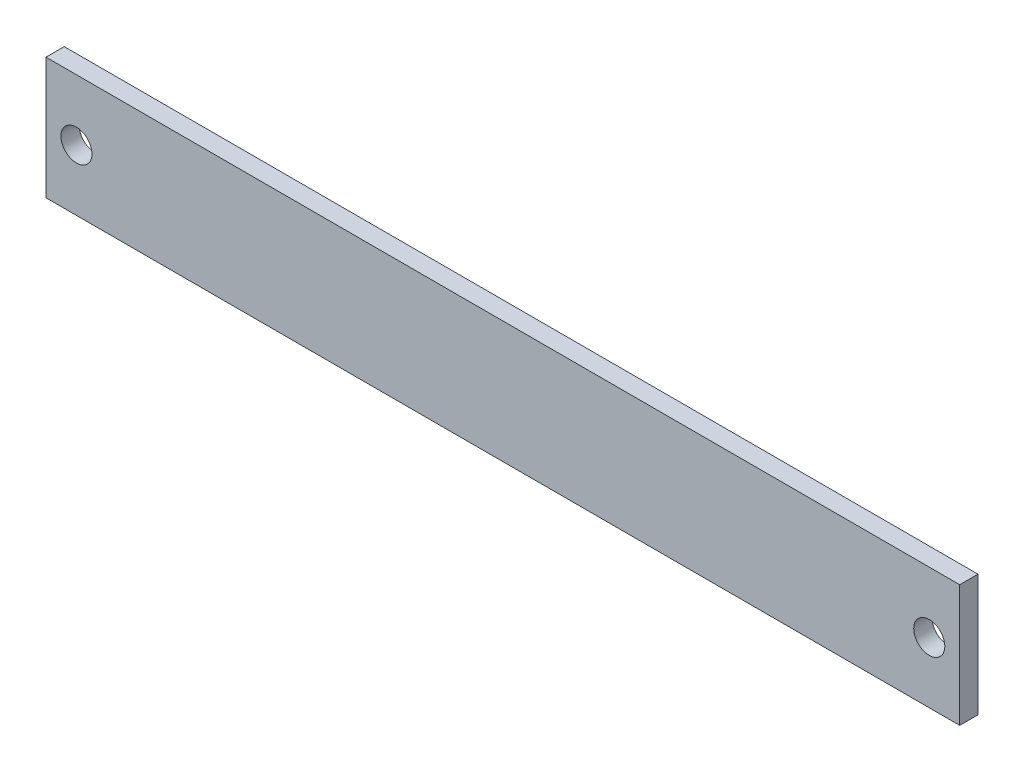
ISO-10303-21;
HEADER;
FILE_DESCRIPTION(('STEP AP214'),'2;1');
FILE_NAME('part.step','',(''),(''),'','','');
FILE_SCHEMA(('AUTOMOTIVE_DESIGN { 1 0 10303 214 1 1 1 1 }'));
ENDSEC;
DATA;
#1=APPLICATION_CONTEXT('core data for automotive mechanical design processes');
#2=APPLICATION_PROTOCOL_DEFINITION('international standard','automotive_design',2000,#1);
#3=PRODUCT_CONTEXT('',#1,'mechanical');
#4=PRODUCT('Part','Part','',(#3));
#5=PRODUCT_RELATED_PRODUCT_CATEGORY('part','',(#4));
#6=PRODUCT_DEFINITION_FORMATION('','',#4);
#7=PRODUCT_DEFINITION_CONTEXT('part definition',#1,'design');
#8=PRODUCT_DEFINITION('design','',#6,#7);
#9=PRODUCT_DEFINITION_SHAPE('','',#8);
#10=(LENGTH_UNIT() NAMED_UNIT(*) SI_UNIT(.MILLI.,.METRE.));
#11=(NAMED_UNIT(*) PLANE_ANGLE_UNIT() SI_UNIT($,.RADIAN.));
#12=(NAMED_UNIT(*) SI_UNIT($,.STERADIAN.) SOLID_ANGLE_UNIT());
#13=UNCERTAINTY_MEASURE_WITH_UNIT(LENGTH_MEASURE(1.E-05),#10,'distance_accuracy_value','');
#14=(GEOMETRIC_REPRESENTATION_CONTEXT(3) GLOBAL_UNCERTAINTY_ASSIGNED_CONTEXT((#13)) GLOBAL_UNIT_ASSIGNED_CONTEXT((#10,
#11,#12)) REPRESENTATION_CONTEXT('',''));
#15=CARTESIAN_POINT('',(0.,0.,0.));
#16=DIRECTION('',(0.,0.,1.));
#17=DIRECTION('',(1.,0.,0.));
#18=AXIS2_PLACEMENT_3D('',#15,#16,#17);
#19=CARTESIAN_POINT('',(0.,0.,6.));
#20=DIRECTION('',(0.,0.,1.));
#21=DIRECTION('',(1.,0.,0.));
#22=AXIS2_PLACEMENT_3D('',#19,#20,#21);
#23=PLANE('',#22);
#24=CARTESIAN_POINT('',(-140.,0.,6.));
#25=DIRECTION('',(0.,0.,1.));
#26=DIRECTION('',(1.,0.,0.));
#27=AXIS2_PLACEMENT_3D('',#24,#25,#26);
#28=CIRCLE('',#27,5.09999999999998);
#29=CARTESIAN_POINT('',(-134.9,0.,6.));
#30=VERTEX_POINT('',#29);
#31=EDGE_CURVE('E102',#30,#30,#28,.T.);
#32=ORIENTED_EDGE('',*,*,#31,.F.);
#33=EDGE_LOOP('',(#32));
#34=FACE_BOUND('',#33,.T.);
#35=DIRECTION('',(0.,1.,0.));
#36=VECTOR('',#35,1.);
#37=CARTESIAN_POINT('',(150.,20.,6.));
#38=LINE('',#37,#36);
#39=CARTESIAN_POINT('',(150.,-20.,6.));
#40=VERTEX_POINT('',#39);
#41=CARTESIAN_POINT('',(150.,20.,6.));
#42=VERTEX_POINT('',#41);
#43=EDGE_CURVE('E87',#40,#42,#38,.T.);
#44=ORIENTED_EDGE('',*,*,#43,.T.);
#45=DIRECTION('',(-1.,0.,0.));
#46=VECTOR('',#45,1.);
#47=CARTESIAN_POINT('',(-150.,20.,6.));
#48=LINE('',#47,#46);
#49=CARTESIAN_POINT('',(-150.,20.,6.));
#50=VERTEX_POINT('',#49);
#51=EDGE_CURVE('E82',#42,#50,#48,.T.);
#52=ORIENTED_EDGE('',*,*,#51,.T.);
#53=DIRECTION('',(0.,-1.,0.));
#54=VECTOR('',#53,1.);
#55=CARTESIAN_POINT('',(-150.,20.,6.));
#56=LINE('',#55,#54);
#57=CARTESIAN_POINT('',(-150.,-20.,6.));
#58=VERTEX_POINT('',#57);
#59=EDGE_CURVE('E85',#50,#58,#56,.T.);
#60=ORIENTED_EDGE('',*,*,#59,.T.);
#61=DIRECTION('',(1.,0.,0.));
#62=VECTOR('',#61,1.);
#63=CARTESIAN_POINT('',(-150.,-20.,6.));
#64=LINE('',#63,#62);
#65=EDGE_CURVE('E52',#58,#40,#64,.T.);
#66=ORIENTED_EDGE('',*,*,#65,.T.);
#67=EDGE_LOOP('',(#44,#52,#60,#66));
#68=FACE_BOUND('',#67,.T.);
#69=CARTESIAN_POINT('',(140.,0.,6.));
#70=DIRECTION('',(0.,0.,1.));
#71=DIRECTION('',(-1.,0.,0.));
#72=AXIS2_PLACEMENT_3D('',#69,#70,#71);
#73=CIRCLE('',#72,5.09999999999998);
#74=CARTESIAN_POINT('',(134.9,0.,6.));
#75=VERTEX_POINT('',#74);
#76=EDGE_CURVE('E117',#75,#75,#73,.T.);
#77=ORIENTED_EDGE('',*,*,#76,.F.);
#78=EDGE_LOOP('',(#77));
#79=FACE_BOUND('',#78,.T.);
#80=ADVANCED_FACE('F35',(#34,#68,#79),#23,.T.);
#81=CARTESIAN_POINT('',(0.,0.,0.));
#82=DIRECTION('',(0.,0.,1.));
#83=DIRECTION('',(1.,0.,0.));
#84=AXIS2_PLACEMENT_3D('',#81,#82,#83);
#85=PLANE('',#84);
#86=DIRECTION('',(0.,1.,0.));
#87=VECTOR('',#86,1.);
#88=CARTESIAN_POINT('',(150.,20.,0.));
#89=LINE('',#88,#87);
#90=CARTESIAN_POINT('',(150.,-20.,0.));
#91=VERTEX_POINT('',#90);
#92=CARTESIAN_POINT('',(150.,20.,0.));
#93=VERTEX_POINT('',#92);
#94=EDGE_CURVE('E99',#91,#93,#89,.T.);
#95=ORIENTED_EDGE('',*,*,#94,.F.);
#96=DIRECTION('',(1.,0.,0.));
#97=VECTOR('',#96,1.);
#98=CARTESIAN_POINT('',(-150.,-20.,0.));
#99=LINE('',#98,#97);
#100=CARTESIAN_POINT('',(-150.,-20.,0.));
#101=VERTEX_POINT('',#100);
#102=EDGE_CURVE('E75',#101,#91,#99,.T.);
#103=ORIENTED_EDGE('',*,*,#102,.F.);
#104=DIRECTION('',(0.,-1.,0.));
#105=VECTOR('',#104,1.);
#106=CARTESIAN_POINT('',(-150.,20.,0.));
#107=LINE('',#106,#105);
#108=CARTESIAN_POINT('',(-150.,20.,0.));
#109=VERTEX_POINT('',#108);
#110=EDGE_CURVE('E69',#109,#101,#107,.T.);
#111=ORIENTED_EDGE('',*,*,#110,.F.);
#112=DIRECTION('',(-1.,0.,0.));
#113=VECTOR('',#112,1.);
#114=CARTESIAN_POINT('',(-150.,20.,0.));
#115=LINE('',#114,#113);
#116=EDGE_CURVE('E91',#93,#109,#115,.T.);
#117=ORIENTED_EDGE('',*,*,#116,.F.);
#118=EDGE_LOOP('',(#95,#103,#111,#117));
#119=FACE_BOUND('',#118,.T.);
#120=CARTESIAN_POINT('',(-140.,0.,0.));
#121=DIRECTION('',(0.,0.,1.));
#122=DIRECTION('',(1.,0.,0.));
#123=AXIS2_PLACEMENT_3D('',#120,#121,#122);
#124=CIRCLE('',#123,5.09999999999998);
#125=CARTESIAN_POINT('',(-134.9,0.,0.));
#126=VERTEX_POINT('',#125);
#127=EDGE_CURVE('E114',#126,#126,#124,.T.);
#128=ORIENTED_EDGE('',*,*,#127,.T.);
#129=EDGE_LOOP('',(#128));
#130=FACE_BOUND('',#129,.T.);
#131=CARTESIAN_POINT('',(140.,0.,0.));
#132=DIRECTION('',(0.,0.,1.));
#133=DIRECTION('',(-1.,0.,0.));
#134=AXIS2_PLACEMENT_3D('',#131,#132,#133);
#135=CIRCLE('',#134,5.09999999999998);
#136=CARTESIAN_POINT('',(134.9,0.,0.));
#137=VERTEX_POINT('',#136);
#138=EDGE_CURVE('E120',#137,#137,#135,.T.);
#139=ORIENTED_EDGE('',*,*,#138,.T.);
#140=EDGE_LOOP('',(#139));
#141=FACE_BOUND('',#140,.T.);
#142=ADVANCED_FACE('F110',(#119,#130,#141),#85,.F.);
#143=CARTESIAN_POINT('',(150.,20.,6.));
#144=DIRECTION('',(-1.,0.,0.));
#145=DIRECTION('',(0.,0.,1.));
#146=AXIS2_PLACEMENT_3D('',#143,#144,#145);
#147=PLANE('',#146);
#148=ORIENTED_EDGE('',*,*,#94,.T.);
#149=DIRECTION('',(0.,0.,-1.));
#150=VECTOR('',#149,1.);
#151=CARTESIAN_POINT('',(150.,20.,6.));
#152=LINE('',#151,#150);
#153=EDGE_CURVE('E11',#42,#93,#152,.T.);
#154=ORIENTED_EDGE('',*,*,#153,.F.);
#155=ORIENTED_EDGE('',*,*,#43,.F.);
#156=DIRECTION('',(0.,0.,-1.));
#157=VECTOR('',#156,1.);
#158=CARTESIAN_POINT('',(150.,-20.,6.));
#159=LINE('',#158,#157);
#160=EDGE_CURVE('E95',#40,#91,#159,.T.);
#161=ORIENTED_EDGE('',*,*,#160,.T.);
#162=EDGE_LOOP('',(#148,#154,#155,#161));
#163=FACE_BOUND('',#162,.T.);
#164=ADVANCED_FACE('F37',(#163),#147,.F.);
#165=CARTESIAN_POINT('',(-150.,20.,6.));
#166=DIRECTION('',(0.,-1.,0.));
#167=DIRECTION('',(1.,0.,0.));
#168=AXIS2_PLACEMENT_3D('',#165,#166,#167);
#169=PLANE('',#168);
#170=ORIENTED_EDGE('',*,*,#116,.T.);
#171=DIRECTION('',(0.,0.,-1.));
#172=VECTOR('',#171,1.);
#173=CARTESIAN_POINT('',(-150.,20.,6.));
#174=LINE('',#173,#172);
#175=EDGE_CURVE('E44',#50,#109,#174,.T.);
#176=ORIENTED_EDGE('',*,*,#175,.F.);
#177=ORIENTED_EDGE('',*,*,#51,.F.);
#178=ORIENTED_EDGE('',*,*,#153,.T.);
#179=EDGE_LOOP('',(#170,#176,#177,#178));
#180=FACE_BOUND('',#179,.T.);
#181=ADVANCED_FACE('F90',(#180),#169,.F.);
#182=CARTESIAN_POINT('',(-150.,20.,6.));
#183=DIRECTION('',(1.,0.,0.));
#184=DIRECTION('',(0.,0.,-1.));
#185=AXIS2_PLACEMENT_3D('',#182,#183,#184);
#186=PLANE('',#185);
#187=ORIENTED_EDGE('',*,*,#110,.T.);
#188=DIRECTION('',(0.,0.,-1.));
#189=VECTOR('',#188,1.);
#190=CARTESIAN_POINT('',(-150.,-20.,6.));
#191=LINE('',#190,#189);
#192=EDGE_CURVE('E92',#58,#101,#191,.T.);
#193=ORIENTED_EDGE('',*,*,#192,.F.);
#194=ORIENTED_EDGE('',*,*,#59,.F.);
#195=ORIENTED_EDGE('',*,*,#175,.T.);
#196=EDGE_LOOP('',(#187,#193,#194,#195));
#197=FACE_BOUND('',#196,.T.);
#198=ADVANCED_FACE('F93',(#197),#186,.F.);
#199=CARTESIAN_POINT('',(-150.,-20.,6.));
#200=DIRECTION('',(0.,1.,0.));
#201=DIRECTION('',(-1.,0.,0.));
#202=AXIS2_PLACEMENT_3D('',#199,#200,#201);
#203=PLANE('',#202);
#204=ORIENTED_EDGE('',*,*,#102,.T.);
#205=ORIENTED_EDGE('',*,*,#160,.F.);
#206=ORIENTED_EDGE('',*,*,#65,.F.);
#207=ORIENTED_EDGE('',*,*,#192,.T.);
#208=EDGE_LOOP('',(#204,#205,#206,#207));
#209=FACE_BOUND('',#208,.T.);
#210=ADVANCED_FACE('F107',(#209),#203,.F.);
#211=CARTESIAN_POINT('',(-140.,0.,6.));
#212=DIRECTION('',(0.,0.,-1.));
#213=DIRECTION('',(-1.,0.,0.));
#214=AXIS2_PLACEMENT_3D('',#211,#212,#213);
#215=CYLINDRICAL_SURFACE('',#214,5.09999999999998);
#216=ORIENTED_EDGE('',*,*,#31,.T.);
#217=EDGE_LOOP('',(#216));
#218=FACE_BOUND('',#217,.T.);
#219=ORIENTED_EDGE('',*,*,#127,.F.);
#220=EDGE_LOOP('',(#219));
#221=FACE_BOUND('',#220,.T.);
#222=ADVANCED_FACE('F137',(#218,#221),#215,.F.);
#223=CARTESIAN_POINT('',(140.,0.,6.));
#224=DIRECTION('',(0.,0.,-1.));
#225=DIRECTION('',(-1.,0.,0.));
#226=AXIS2_PLACEMENT_3D('',#223,#224,#225);
#227=CYLINDRICAL_SURFACE('',#226,5.09999999999998);
#228=ORIENTED_EDGE('',*,*,#76,.T.);
#229=EDGE_LOOP('',(#228));
#230=FACE_BOUND('',#229,.T.);
#231=ORIENTED_EDGE('',*,*,#138,.F.);
#232=EDGE_LOOP('',(#231));
#233=FACE_BOUND('',#232,.T.);
#234=ADVANCED_FACE('F126',(#230,#233),#227,.F.);
#235=CLOSED_SHELL('',(#80,#142,#164,#181,#198,#210,#222,#234));
#236=MANIFOLD_SOLID_BREP('B2',#235);
#237=ADVANCED_BREP_SHAPE_REPRESENTATION('',(#18,#236),#14);
#238=SHAPE_DEFINITION_REPRESENTATION(#9,#237);
ENDSEC;
END-ISO-10303-21;
